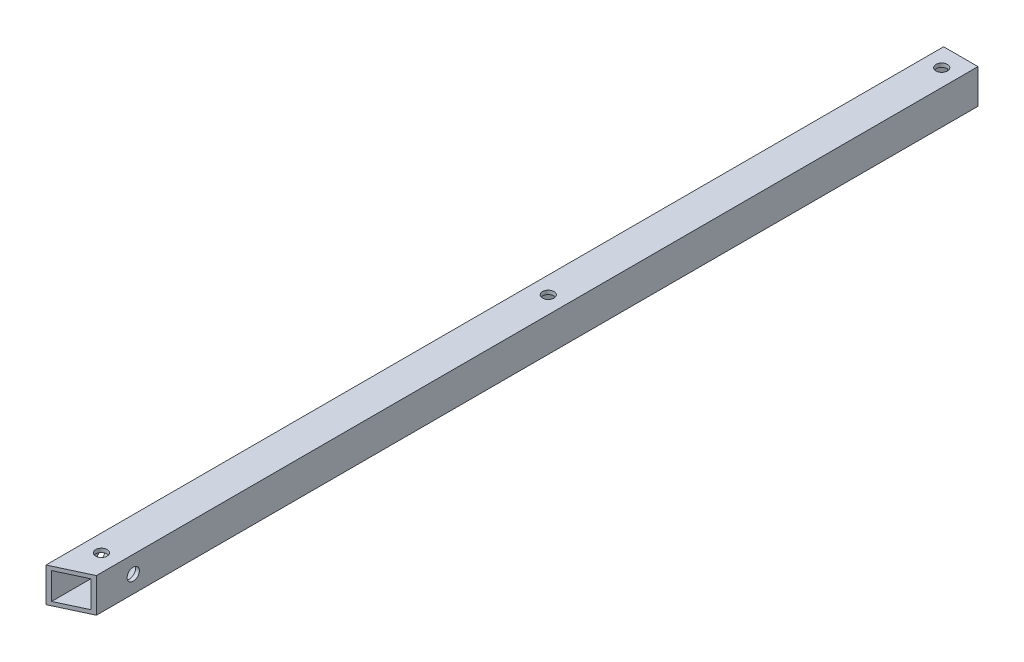
ISO-10303-21;
HEADER;
FILE_DESCRIPTION(('STEP AP214'),'2;1');
FILE_NAME('part.step','',(''),(''),'','','');
FILE_SCHEMA(('AUTOMOTIVE_DESIGN { 1 0 10303 214 1 1 1 1 }'));
ENDSEC;
DATA;
#1=APPLICATION_CONTEXT('core data for automotive mechanical design processes');
#2=APPLICATION_PROTOCOL_DEFINITION('international standard','automotive_design',2000,#1);
#3=PRODUCT_CONTEXT('',#1,'mechanical');
#4=PRODUCT('Part','Part','',(#3));
#5=PRODUCT_RELATED_PRODUCT_CATEGORY('part','',(#4));
#6=PRODUCT_DEFINITION_FORMATION('','',#4);
#7=PRODUCT_DEFINITION_CONTEXT('part definition',#1,'design');
#8=PRODUCT_DEFINITION('design','',#6,#7);
#9=PRODUCT_DEFINITION_SHAPE('','',#8);
#10=(LENGTH_UNIT() NAMED_UNIT(*) SI_UNIT(.MILLI.,.METRE.));
#11=(NAMED_UNIT(*) PLANE_ANGLE_UNIT() SI_UNIT($,.RADIAN.));
#12=(NAMED_UNIT(*) SI_UNIT($,.STERADIAN.) SOLID_ANGLE_UNIT());
#13=UNCERTAINTY_MEASURE_WITH_UNIT(LENGTH_MEASURE(1.E-05),#10,'distance_accuracy_value','');
#14=(GEOMETRIC_REPRESENTATION_CONTEXT(3) GLOBAL_UNCERTAINTY_ASSIGNED_CONTEXT((#13)) GLOBAL_UNIT_ASSIGNED_CONTEXT((#10,
#11,#12)) REPRESENTATION_CONTEXT('',''));
#15=CARTESIAN_POINT('',(0.,0.,0.));
#16=DIRECTION('',(0.,0.,1.));
#17=DIRECTION('',(1.,0.,0.));
#18=AXIS2_PLACEMENT_3D('',#15,#16,#17);
#19=CARTESIAN_POINT('',(4.5,4.5,235.));
#20=DIRECTION('',(-1.,0.,0.));
#21=DIRECTION('',(0.,0.,1.));
#22=AXIS2_PLACEMENT_3D('',#19,#20,#21);
#23=PLANE('',#22);
#24=CARTESIAN_POINT('',(4.5,0.,221.153231076605));
#25=DIRECTION('',(1.,0.,0.));
#26=DIRECTION('',(0.,0.,-1.));
#27=AXIS2_PLACEMENT_3D('',#24,#25,#26);
#28=CIRCLE('',#27,1.59999999999999);
#29=CARTESIAN_POINT('',(4.5,0.,219.553231076605));
#30=VERTEX_POINT('',#29);
#31=EDGE_CURVE('E246',#30,#30,#28,.T.);
#32=ORIENTED_EDGE('',*,*,#31,.F.);
#33=EDGE_LOOP('',(#32));
#34=FACE_BOUND('',#33,.T.);
#35=DIRECTION('',(0.,0.,-1.));
#36=VECTOR('',#35,1.);
#37=CARTESIAN_POINT('',(4.5,4.5,235.));
#38=LINE('',#37,#36);
#39=CARTESIAN_POINT('',(4.5,4.5,230.803231076605));
#40=VERTEX_POINT('',#39);
#41=CARTESIAN_POINT('',(4.5,4.5,0.));
#42=VERTEX_POINT('',#41);
#43=EDGE_CURVE('E48',#40,#42,#38,.T.);
#44=ORIENTED_EDGE('',*,*,#43,.F.);
#45=DIRECTION('',(0.,-1.,0.));
#46=VECTOR('',#45,1.);
#47=CARTESIAN_POINT('',(4.5,4.5,230.803231076605));
#48=LINE('',#47,#46);
#49=CARTESIAN_POINT('',(4.5,-4.5,230.803231076605));
#50=VERTEX_POINT('',#49);
#51=EDGE_CURVE('E104',#40,#50,#48,.T.);
#52=ORIENTED_EDGE('',*,*,#51,.T.);
#53=DIRECTION('',(0.,0.,-1.));
#54=VECTOR('',#53,1.);
#55=CARTESIAN_POINT('',(4.5,-4.5,235.));
#56=LINE('',#55,#54);
#57=CARTESIAN_POINT('',(4.5,-4.5,0.));
#58=VERTEX_POINT('',#57);
#59=EDGE_CURVE('E204',#50,#58,#56,.T.);
#60=ORIENTED_EDGE('',*,*,#59,.T.);
#61=DIRECTION('',(0.,1.,0.));
#62=VECTOR('',#61,1.);
#63=CARTESIAN_POINT('',(4.5,4.5,0.));
#64=LINE('',#63,#62);
#65=EDGE_CURVE('E128',#58,#42,#64,.T.);
#66=ORIENTED_EDGE('',*,*,#65,.T.);
#67=EDGE_LOOP('',(#44,#52,#60,#66));
#68=FACE_BOUND('',#67,.T.);
#69=ADVANCED_FACE('F39',(#34,#68),#23,.F.);
#70=CARTESIAN_POINT('',(-4.5,4.5,235.));
#71=DIRECTION('',(0.,-1.,0.));
#72=DIRECTION('',(0.,0.,-1.));
#73=AXIS2_PLACEMENT_3D('',#70,#71,#72);
#74=PLANE('',#73);
#75=CARTESIAN_POINT('',(0.,4.5,225.));
#76=DIRECTION('',(0.,1.,0.));
#77=DIRECTION('',(0.,0.,1.));
#78=AXIS2_PLACEMENT_3D('',#75,#76,#77);
#79=CIRCLE('',#78,1.5);
#80=CARTESIAN_POINT('',(0.,4.5,226.5));
#81=VERTEX_POINT('',#80);
#82=EDGE_CURVE('E141',#81,#81,#79,.T.);
#83=ORIENTED_EDGE('',*,*,#82,.F.);
#84=EDGE_LOOP('',(#83));
#85=FACE_BOUND('',#84,.T.);
#86=CARTESIAN_POINT('',(0.,4.5,108.));
#87=DIRECTION('',(0.,1.,0.));
#88=DIRECTION('',(0.,0.,1.));
#89=AXIS2_PLACEMENT_3D('',#86,#87,#88);
#90=CIRCLE('',#89,1.5);
#91=CARTESIAN_POINT('',(0.,4.5,109.5));
#92=VERTEX_POINT('',#91);
#93=EDGE_CURVE('E274',#92,#92,#90,.T.);
#94=ORIENTED_EDGE('',*,*,#93,.F.);
#95=EDGE_LOOP('',(#94));
#96=FACE_BOUND('',#95,.T.);
#97=CARTESIAN_POINT('',(0.,4.5,5.));
#98=DIRECTION('',(0.,1.,0.));
#99=DIRECTION('',(0.,0.,1.));
#100=AXIS2_PLACEMENT_3D('',#97,#98,#99);
#101=CIRCLE('',#100,1.5);
#102=CARTESIAN_POINT('',(0.,4.5,6.5));
#103=VERTEX_POINT('',#102);
#104=EDGE_CURVE('E115',#103,#103,#101,.T.);
#105=ORIENTED_EDGE('',*,*,#104,.F.);
#106=EDGE_LOOP('',(#105));
#107=FACE_BOUND('',#106,.T.);
#108=DIRECTION('',(0.,0.,-1.));
#109=VECTOR('',#108,1.);
#110=CARTESIAN_POINT('',(-4.5,4.5,235.));
#111=LINE('',#110,#109);
#112=CARTESIAN_POINT('',(-4.5,4.5,235.));
#113=VERTEX_POINT('',#112);
#114=CARTESIAN_POINT('',(-4.5,4.5,0.));
#115=VERTEX_POINT('',#114);
#116=EDGE_CURVE('E121',#113,#115,#111,.T.);
#117=ORIENTED_EDGE('',*,*,#116,.F.);
#118=DIRECTION('',(-0.906307787036652,0.,0.422618261740695));
#119=VECTOR('',#118,1.);
#120=CARTESIAN_POINT('',(-4.5,4.5,235.));
#121=LINE('',#120,#119);
#122=EDGE_CURVE('E107',#40,#113,#121,.T.);
#123=ORIENTED_EDGE('',*,*,#122,.F.);
#124=ORIENTED_EDGE('',*,*,#43,.T.);
#125=DIRECTION('',(-1.,0.,0.));
#126=VECTOR('',#125,1.);
#127=CARTESIAN_POINT('',(-4.5,4.5,0.));
#128=LINE('',#127,#126);
#129=EDGE_CURVE('E208',#42,#115,#128,.T.);
#130=ORIENTED_EDGE('',*,*,#129,.T.);
#131=EDGE_LOOP('',(#117,#123,#124,#130));
#132=FACE_BOUND('',#131,.T.);
#133=ADVANCED_FACE('F118',(#85,#96,#107,#132),#74,.F.);
#134=CARTESIAN_POINT('',(-4.5,4.5,235.));
#135=DIRECTION('',(1.,0.,0.));
#136=DIRECTION('',(0.,1.,0.));
#137=AXIS2_PLACEMENT_3D('',#134,#135,#136);
#138=PLANE('',#137);
#139=CARTESIAN_POINT('',(-4.5,0.,221.153231076605));
#140=DIRECTION('',(1.,0.,0.));
#141=DIRECTION('',(0.,1.,0.));
#142=AXIS2_PLACEMENT_3D('',#139,#140,#141);
#143=CIRCLE('',#142,1.59999999999999);
#144=CARTESIAN_POINT('',(-4.5,1.59999999999999,221.153231076605));
#145=VERTEX_POINT('',#144);
#146=EDGE_CURVE('E124',#145,#145,#143,.T.);
#147=ORIENTED_EDGE('',*,*,#146,.T.);
#148=EDGE_LOOP('',(#147));
#149=FACE_BOUND('',#148,.T.);
#150=DIRECTION('',(0.,-1.,0.));
#151=VECTOR('',#150,1.);
#152=CARTESIAN_POINT('',(-4.5,4.5,0.));
#153=LINE('',#152,#151);
#154=CARTESIAN_POINT('',(-4.5,-4.5,0.));
#155=VERTEX_POINT('',#154);
#156=EDGE_CURVE('E211',#115,#155,#153,.T.);
#157=ORIENTED_EDGE('',*,*,#156,.T.);
#158=DIRECTION('',(0.,0.,-1.));
#159=VECTOR('',#158,1.);
#160=CARTESIAN_POINT('',(-4.5,-4.5,235.));
#161=LINE('',#160,#159);
#162=CARTESIAN_POINT('',(-4.5,-4.50000000000006,235.));
#163=VERTEX_POINT('',#162);
#164=EDGE_CURVE('E132',#163,#155,#161,.T.);
#165=ORIENTED_EDGE('',*,*,#164,.F.);
#166=DIRECTION('',(0.,-1.,0.));
#167=VECTOR('',#166,1.);
#168=CARTESIAN_POINT('',(-4.5,4.5,235.));
#169=LINE('',#168,#167);
#170=EDGE_CURVE('E201',#113,#163,#169,.T.);
#171=ORIENTED_EDGE('',*,*,#170,.F.);
#172=ORIENTED_EDGE('',*,*,#116,.T.);
#173=EDGE_LOOP('',(#157,#165,#171,#172));
#174=FACE_BOUND('',#173,.T.);
#175=ADVANCED_FACE('F228',(#149,#174),#138,.F.);
#176=CARTESIAN_POINT('',(-4.5,-4.5,235.));
#177=DIRECTION('',(0.,1.,0.));
#178=DIRECTION('',(0.,0.,1.));
#179=AXIS2_PLACEMENT_3D('',#176,#177,#178);
#180=PLANE('',#179);
#181=CARTESIAN_POINT('',(0.,-4.5,225.));
#182=DIRECTION('',(0.,1.,0.));
#183=DIRECTION('',(0.,0.,1.));
#184=AXIS2_PLACEMENT_3D('',#181,#182,#183);
#185=CIRCLE('',#184,1.5);
#186=CARTESIAN_POINT('',(0.,-4.5,226.5));
#187=VERTEX_POINT('',#186);
#188=EDGE_CURVE('E158',#187,#187,#185,.T.);
#189=ORIENTED_EDGE('',*,*,#188,.T.);
#190=EDGE_LOOP('',(#189));
#191=FACE_BOUND('',#190,.T.);
#192=CARTESIAN_POINT('',(0.,-4.5,108.));
#193=DIRECTION('',(0.,1.,0.));
#194=DIRECTION('',(0.,0.,1.));
#195=AXIS2_PLACEMENT_3D('',#192,#193,#194);
#196=CIRCLE('',#195,1.5);
#197=CARTESIAN_POINT('',(0.,-4.5,109.5));
#198=VERTEX_POINT('',#197);
#199=EDGE_CURVE('E152',#198,#198,#196,.T.);
#200=ORIENTED_EDGE('',*,*,#199,.T.);
#201=EDGE_LOOP('',(#200));
#202=FACE_BOUND('',#201,.T.);
#203=CARTESIAN_POINT('',(0.,-4.5,5.));
#204=DIRECTION('',(0.,1.,0.));
#205=DIRECTION('',(0.,0.,1.));
#206=AXIS2_PLACEMENT_3D('',#203,#204,#205);
#207=CIRCLE('',#206,1.5);
#208=CARTESIAN_POINT('',(0.,-4.5,6.5));
#209=VERTEX_POINT('',#208);
#210=EDGE_CURVE('E147',#209,#209,#207,.T.);
#211=ORIENTED_EDGE('',*,*,#210,.T.);
#212=EDGE_LOOP('',(#211));
#213=FACE_BOUND('',#212,.T.);
#214=ORIENTED_EDGE('',*,*,#59,.F.);
#215=DIRECTION('',(-0.906307787036652,0.,0.422618261740695));
#216=VECTOR('',#215,1.);
#217=CARTESIAN_POINT('',(-4.5,-4.5,235.));
#218=LINE('',#217,#216);
#219=EDGE_CURVE('E110',#50,#163,#218,.T.);
#220=ORIENTED_EDGE('',*,*,#219,.T.);
#221=ORIENTED_EDGE('',*,*,#164,.T.);
#222=DIRECTION('',(1.,0.,0.));
#223=VECTOR('',#222,1.);
#224=CARTESIAN_POINT('',(-4.5,-4.5,0.));
#225=LINE('',#224,#223);
#226=EDGE_CURVE('E205',#155,#58,#225,.T.);
#227=ORIENTED_EDGE('',*,*,#226,.T.);
#228=EDGE_LOOP('',(#214,#220,#221,#227));
#229=FACE_BOUND('',#228,.T.);
#230=ADVANCED_FACE('F223',(#191,#202,#213,#229),#180,.F.);
#231=CARTESIAN_POINT('',(0.,0.,0.));
#232=DIRECTION('',(0.,0.,1.));
#233=DIRECTION('',(1.,0.,0.));
#234=AXIS2_PLACEMENT_3D('',#231,#232,#233);
#235=PLANE('',#234);
#236=DIRECTION('',(1.,0.,0.));
#237=VECTOR('',#236,1.);
#238=CARTESIAN_POINT('',(-3.5,-3.5,0.));
#239=LINE('',#238,#237);
#240=CARTESIAN_POINT('',(-3.5,-3.5,0.));
#241=VERTEX_POINT('',#240);
#242=CARTESIAN_POINT('',(3.5,-3.5,0.));
#243=VERTEX_POINT('',#242);
#244=EDGE_CURVE('E182',#241,#243,#239,.T.);
#245=ORIENTED_EDGE('',*,*,#244,.T.);
#246=DIRECTION('',(0.,1.,0.));
#247=VECTOR('',#246,1.);
#248=CARTESIAN_POINT('',(3.5,3.5,0.));
#249=LINE('',#248,#247);
#250=CARTESIAN_POINT('',(3.5,3.5,0.));
#251=VERTEX_POINT('',#250);
#252=EDGE_CURVE('E172',#243,#251,#249,.T.);
#253=ORIENTED_EDGE('',*,*,#252,.T.);
#254=DIRECTION('',(-1.,0.,0.));
#255=VECTOR('',#254,1.);
#256=CARTESIAN_POINT('',(-3.5,3.5,0.));
#257=LINE('',#256,#255);
#258=CARTESIAN_POINT('',(-3.5,3.5,0.));
#259=VERTEX_POINT('',#258);
#260=EDGE_CURVE('E176',#251,#259,#257,.T.);
#261=ORIENTED_EDGE('',*,*,#260,.T.);
#262=DIRECTION('',(0.,-1.,0.));
#263=VECTOR('',#262,1.);
#264=CARTESIAN_POINT('',(-3.5,3.5,0.));
#265=LINE('',#264,#263);
#266=EDGE_CURVE('E62',#259,#241,#265,.T.);
#267=ORIENTED_EDGE('',*,*,#266,.T.);
#268=EDGE_LOOP('',(#245,#253,#261,#267));
#269=FACE_BOUND('',#268,.T.);
#270=ORIENTED_EDGE('',*,*,#65,.F.);
#271=ORIENTED_EDGE('',*,*,#226,.F.);
#272=ORIENTED_EDGE('',*,*,#156,.F.);
#273=ORIENTED_EDGE('',*,*,#129,.F.);
#274=EDGE_LOOP('',(#270,#271,#272,#273));
#275=FACE_BOUND('',#274,.T.);
#276=ADVANCED_FACE('F227',(#269,#275),#235,.F.);
#277=CARTESIAN_POINT('',(3.5,3.5,0.));
#278=DIRECTION('',(1.,0.,0.));
#279=DIRECTION('',(0.,1.,0.));
#280=AXIS2_PLACEMENT_3D('',#277,#278,#279);
#281=PLANE('',#280);
#282=CARTESIAN_POINT('',(3.5,0.,221.153231076605));
#283=DIRECTION('',(1.,0.,0.));
#284=DIRECTION('',(0.,1.,0.));
#285=AXIS2_PLACEMENT_3D('',#282,#283,#284);
#286=CIRCLE('',#285,1.59999999999999);
#287=CARTESIAN_POINT('',(3.5,1.59999999999999,221.153231076605));
#288=VERTEX_POINT('',#287);
#289=EDGE_CURVE('E252',#288,#288,#286,.T.);
#290=ORIENTED_EDGE('',*,*,#289,.T.);
#291=EDGE_LOOP('',(#290));
#292=FACE_BOUND('',#291,.T.);
#293=DIRECTION('',(0.,0.,1.));
#294=VECTOR('',#293,1.);
#295=CARTESIAN_POINT('',(3.5,-3.5,0.));
#296=LINE('',#295,#294);
#297=CARTESIAN_POINT('',(3.5,-3.5,231.26953873476));
#298=VERTEX_POINT('',#297);
#299=EDGE_CURVE('E187',#243,#298,#296,.T.);
#300=ORIENTED_EDGE('',*,*,#299,.T.);
#301=DIRECTION('',(0.,1.,0.));
#302=VECTOR('',#301,1.);
#303=CARTESIAN_POINT('',(3.5,3.49999999999999,231.26953873476));
#304=LINE('',#303,#302);
#305=CARTESIAN_POINT('',(3.5,3.5,231.26953873476));
#306=VERTEX_POINT('',#305);
#307=EDGE_CURVE('E265',#298,#306,#304,.T.);
#308=ORIENTED_EDGE('',*,*,#307,.T.);
#309=DIRECTION('',(0.,0.,1.));
#310=VECTOR('',#309,1.);
#311=CARTESIAN_POINT('',(3.5,3.5,0.));
#312=LINE('',#311,#310);
#313=EDGE_CURVE('E186',#251,#306,#312,.T.);
#314=ORIENTED_EDGE('',*,*,#313,.F.);
#315=ORIENTED_EDGE('',*,*,#252,.F.);
#316=EDGE_LOOP('',(#300,#308,#314,#315));
#317=FACE_BOUND('',#316,.T.);
#318=ADVANCED_FACE('F325',(#292,#317),#281,.F.);
#319=CARTESIAN_POINT('',(-3.5,-3.5,0.));
#320=DIRECTION('',(0.,-1.,0.));
#321=DIRECTION('',(0.,0.,-1.));
#322=AXIS2_PLACEMENT_3D('',#319,#320,#321);
#323=PLANE('',#322);
#324=CARTESIAN_POINT('',(0.,-3.5,225.));
#325=DIRECTION('',(0.,-1.,0.));
#326=DIRECTION('',(0.,0.,-1.));
#327=AXIS2_PLACEMENT_3D('',#324,#325,#326);
#328=CIRCLE('',#327,1.5);
#329=CARTESIAN_POINT('',(0.,-3.5,223.5));
#330=VERTEX_POINT('',#329);
#331=EDGE_CURVE('E151',#330,#330,#328,.T.);
#332=ORIENTED_EDGE('',*,*,#331,.T.);
#333=EDGE_LOOP('',(#332));
#334=FACE_BOUND('',#333,.T.);
#335=CARTESIAN_POINT('',(0.,-3.5,108.));
#336=DIRECTION('',(0.,-1.,0.));
#337=DIRECTION('',(0.,0.,-1.));
#338=AXIS2_PLACEMENT_3D('',#335,#336,#337);
#339=CIRCLE('',#338,1.5);
#340=CARTESIAN_POINT('',(0.,-3.5,106.5));
#341=VERTEX_POINT('',#340);
#342=EDGE_CURVE('E146',#341,#341,#339,.T.);
#343=ORIENTED_EDGE('',*,*,#342,.T.);
#344=EDGE_LOOP('',(#343));
#345=FACE_BOUND('',#344,.T.);
#346=CARTESIAN_POINT('',(0.,-3.5,5.));
#347=DIRECTION('',(0.,-1.,0.));
#348=DIRECTION('',(0.,0.,-1.));
#349=AXIS2_PLACEMENT_3D('',#346,#347,#348);
#350=CIRCLE('',#349,1.5);
#351=CARTESIAN_POINT('',(0.,-3.5,3.5));
#352=VERTEX_POINT('',#351);
#353=EDGE_CURVE('E140',#352,#352,#350,.T.);
#354=ORIENTED_EDGE('',*,*,#353,.T.);
#355=EDGE_LOOP('',(#354));
#356=FACE_BOUND('',#355,.T.);
#357=DIRECTION('',(0.,0.,1.));
#358=VECTOR('',#357,1.);
#359=CARTESIAN_POINT('',(-3.5,-3.5,0.));
#360=LINE('',#359,#358);
#361=CARTESIAN_POINT('',(-3.5,-3.5,234.533692341845));
#362=VERTEX_POINT('',#361);
#363=EDGE_CURVE('E191',#241,#362,#360,.T.);
#364=ORIENTED_EDGE('',*,*,#363,.T.);
#365=DIRECTION('',(0.906307787036652,0.,-0.422618261740695));
#366=VECTOR('',#365,1.);
#367=CARTESIAN_POINT('',(86.3316158713224,-3.5,192.64452191661));
#368=LINE('',#367,#366);
#369=EDGE_CURVE('E261',#362,#298,#368,.T.);
#370=ORIENTED_EDGE('',*,*,#369,.T.);
#371=ORIENTED_EDGE('',*,*,#299,.F.);
#372=ORIENTED_EDGE('',*,*,#244,.F.);
#373=EDGE_LOOP('',(#364,#370,#371,#372));
#374=FACE_BOUND('',#373,.T.);
#375=ADVANCED_FACE('F327',(#334,#345,#356,#374),#323,.F.);
#376=CARTESIAN_POINT('',(-3.5,3.5,0.));
#377=DIRECTION('',(-1.,0.,0.));
#378=DIRECTION('',(0.,-1.,0.));
#379=AXIS2_PLACEMENT_3D('',#376,#377,#378);
#380=PLANE('',#379);
#381=CARTESIAN_POINT('',(-3.5,0.,221.153231076605));
#382=DIRECTION('',(-1.,0.,0.));
#383=DIRECTION('',(0.,-1.,0.));
#384=AXIS2_PLACEMENT_3D('',#381,#382,#383);
#385=CIRCLE('',#384,1.59999999999999);
#386=CARTESIAN_POINT('',(-3.5,-1.59999999999999,221.153231076605));
#387=VERTEX_POINT('',#386);
#388=EDGE_CURVE('E42',#387,#387,#385,.T.);
#389=ORIENTED_EDGE('',*,*,#388,.T.);
#390=EDGE_LOOP('',(#389));
#391=FACE_BOUND('',#390,.T.);
#392=DIRECTION('',(0.,0.,1.));
#393=VECTOR('',#392,1.);
#394=CARTESIAN_POINT('',(-3.5,3.5,0.));
#395=LINE('',#394,#393);
#396=CARTESIAN_POINT('',(-3.5,3.5,234.533692341845));
#397=VERTEX_POINT('',#396);
#398=EDGE_CURVE('E195',#259,#397,#395,.T.);
#399=ORIENTED_EDGE('',*,*,#398,.T.);
#400=DIRECTION('',(0.,-1.,0.));
#401=VECTOR('',#400,1.);
#402=CARTESIAN_POINT('',(-3.5,3.49999999999999,234.533692341845));
#403=LINE('',#402,#401);
#404=EDGE_CURVE('E55',#397,#362,#403,.T.);
#405=ORIENTED_EDGE('',*,*,#404,.T.);
#406=ORIENTED_EDGE('',*,*,#363,.F.);
#407=ORIENTED_EDGE('',*,*,#266,.F.);
#408=EDGE_LOOP('',(#399,#405,#406,#407));
#409=FACE_BOUND('',#408,.T.);
#410=ADVANCED_FACE('F315',(#391,#409),#380,.F.);
#411=CARTESIAN_POINT('',(-3.5,3.5,0.));
#412=DIRECTION('',(0.,1.,0.));
#413=DIRECTION('',(0.,0.,1.));
#414=AXIS2_PLACEMENT_3D('',#411,#412,#413);
#415=PLANE('',#414);
#416=CARTESIAN_POINT('',(0.,3.5,225.));
#417=DIRECTION('',(0.,1.,0.));
#418=DIRECTION('',(0.,0.,1.));
#419=AXIS2_PLACEMENT_3D('',#416,#417,#418);
#420=CIRCLE('',#419,1.5);
#421=CARTESIAN_POINT('',(0.,3.5,226.5));
#422=VERTEX_POINT('',#421);
#423=EDGE_CURVE('E148',#422,#422,#420,.T.);
#424=ORIENTED_EDGE('',*,*,#423,.T.);
#425=EDGE_LOOP('',(#424));
#426=FACE_BOUND('',#425,.T.);
#427=CARTESIAN_POINT('',(0.,3.5,108.));
#428=DIRECTION('',(0.,1.,0.));
#429=DIRECTION('',(0.,0.,1.));
#430=AXIS2_PLACEMENT_3D('',#427,#428,#429);
#431=CIRCLE('',#430,1.5);
#432=CARTESIAN_POINT('',(0.,3.5,109.5));
#433=VERTEX_POINT('',#432);
#434=EDGE_CURVE('E142',#433,#433,#431,.T.);
#435=ORIENTED_EDGE('',*,*,#434,.T.);
#436=EDGE_LOOP('',(#435));
#437=FACE_BOUND('',#436,.T.);
#438=CARTESIAN_POINT('',(0.,3.5,5.));
#439=DIRECTION('',(0.,1.,0.));
#440=DIRECTION('',(0.,0.,1.));
#441=AXIS2_PLACEMENT_3D('',#438,#439,#440);
#442=CIRCLE('',#441,1.5);
#443=CARTESIAN_POINT('',(0.,3.5,6.5));
#444=VERTEX_POINT('',#443);
#445=EDGE_CURVE('E136',#444,#444,#442,.T.);
#446=ORIENTED_EDGE('',*,*,#445,.T.);
#447=EDGE_LOOP('',(#446));
#448=FACE_BOUND('',#447,.T.);
#449=ORIENTED_EDGE('',*,*,#313,.T.);
#450=DIRECTION('',(-0.906307787036652,0.,0.422618261740695));
#451=VECTOR('',#450,1.);
#452=CARTESIAN_POINT('',(86.3316158713224,3.5,192.64452191661));
#453=LINE('',#452,#451);
#454=EDGE_CURVE('E11',#306,#397,#453,.T.);
#455=ORIENTED_EDGE('',*,*,#454,.T.);
#456=ORIENTED_EDGE('',*,*,#398,.F.);
#457=ORIENTED_EDGE('',*,*,#260,.F.);
#458=EDGE_LOOP('',(#449,#455,#456,#457));
#459=FACE_BOUND('',#458,.T.);
#460=ADVANCED_FACE('F308',(#426,#437,#448,#459),#415,.F.);
#461=CARTESIAN_POINT('',(0.,-230.5,5.));
#462=DIRECTION('',(0.,1.,0.));
#463=DIRECTION('',(0.,0.,1.));
#464=AXIS2_PLACEMENT_3D('',#461,#462,#463);
#465=CYLINDRICAL_SURFACE('',#464,1.5);
#466=ORIENTED_EDGE('',*,*,#104,.T.);
#467=EDGE_LOOP('',(#466));
#468=FACE_BOUND('',#467,.T.);
#469=ORIENTED_EDGE('',*,*,#445,.F.);
#470=EDGE_LOOP('',(#469));
#471=FACE_BOUND('',#470,.T.);
#472=ADVANCED_FACE('F294',(#468,#471),#465,.F.);
#473=CARTESIAN_POINT('',(0.,-230.5,108.));
#474=DIRECTION('',(0.,1.,0.));
#475=DIRECTION('',(0.,0.,1.));
#476=AXIS2_PLACEMENT_3D('',#473,#474,#475);
#477=CYLINDRICAL_SURFACE('',#476,1.5);
#478=ORIENTED_EDGE('',*,*,#93,.T.);
#479=EDGE_LOOP('',(#478));
#480=FACE_BOUND('',#479,.T.);
#481=ORIENTED_EDGE('',*,*,#434,.F.);
#482=EDGE_LOOP('',(#481));
#483=FACE_BOUND('',#482,.T.);
#484=ADVANCED_FACE('F302',(#480,#483),#477,.F.);
#485=CARTESIAN_POINT('',(0.,-230.5,225.));
#486=DIRECTION('',(0.,1.,0.));
#487=DIRECTION('',(0.,0.,1.));
#488=AXIS2_PLACEMENT_3D('',#485,#486,#487);
#489=CYLINDRICAL_SURFACE('',#488,1.5);
#490=ORIENTED_EDGE('',*,*,#82,.T.);
#491=EDGE_LOOP('',(#490));
#492=FACE_BOUND('',#491,.T.);
#493=ORIENTED_EDGE('',*,*,#423,.F.);
#494=EDGE_LOOP('',(#493));
#495=FACE_BOUND('',#494,.T.);
#496=ADVANCED_FACE('F291',(#492,#495),#489,.F.);
#497=ORIENTED_EDGE('',*,*,#353,.F.);
#498=EDGE_LOOP('',(#497));
#499=FACE_BOUND('',#498,.T.);
#500=ORIENTED_EDGE('',*,*,#210,.F.);
#501=EDGE_LOOP('',(#500));
#502=FACE_BOUND('',#501,.T.);
#503=ADVANCED_FACE('F288',(#499,#502),#465,.F.);
#504=ORIENTED_EDGE('',*,*,#342,.F.);
#505=EDGE_LOOP('',(#504));
#506=FACE_BOUND('',#505,.T.);
#507=ORIENTED_EDGE('',*,*,#199,.F.);
#508=EDGE_LOOP('',(#507));
#509=FACE_BOUND('',#508,.T.);
#510=ADVANCED_FACE('F290',(#506,#509),#477,.F.);
#511=ORIENTED_EDGE('',*,*,#331,.F.);
#512=EDGE_LOOP('',(#511));
#513=FACE_BOUND('',#512,.T.);
#514=ORIENTED_EDGE('',*,*,#188,.F.);
#515=EDGE_LOOP('',(#514));
#516=FACE_BOUND('',#515,.T.);
#517=ADVANCED_FACE('F299',(#513,#516),#489,.F.);
#518=CARTESIAN_POINT('',(-4.5,-230.5,235.));
#519=DIRECTION('',(-0.422618261740695,0.,-0.906307787036652));
#520=DIRECTION('',(-0.906307787036652,0.,0.422618261740695));
#521=AXIS2_PLACEMENT_3D('',#518,#519,#520);
#522=PLANE('',#521);
#523=ORIENTED_EDGE('',*,*,#369,.F.);
#524=ORIENTED_EDGE('',*,*,#404,.F.);
#525=ORIENTED_EDGE('',*,*,#454,.F.);
#526=ORIENTED_EDGE('',*,*,#307,.F.);
#527=EDGE_LOOP('',(#523,#524,#525,#526));
#528=FACE_BOUND('',#527,.T.);
#529=ORIENTED_EDGE('',*,*,#122,.T.);
#530=ORIENTED_EDGE('',*,*,#170,.T.);
#531=ORIENTED_EDGE('',*,*,#219,.F.);
#532=ORIENTED_EDGE('',*,*,#51,.F.);
#533=EDGE_LOOP('',(#529,#530,#531,#532));
#534=FACE_BOUND('',#533,.T.);
#535=ADVANCED_FACE('F106',(#528,#534),#522,.F.);
#536=CARTESIAN_POINT('',(-5.5,0.,221.153231076605));
#537=DIRECTION('',(1.,0.,0.));
#538=DIRECTION('',(0.,0.,-1.));
#539=AXIS2_PLACEMENT_3D('',#536,#537,#538);
#540=CYLINDRICAL_SURFACE('',#539,1.59999999999999);
#541=ORIENTED_EDGE('',*,*,#388,.F.);
#542=EDGE_LOOP('',(#541));
#543=FACE_BOUND('',#542,.T.);
#544=ORIENTED_EDGE('',*,*,#146,.F.);
#545=EDGE_LOOP('',(#544));
#546=FACE_BOUND('',#545,.T.);
#547=ADVANCED_FACE('F356',(#543,#546),#540,.F.);
#548=ORIENTED_EDGE('',*,*,#31,.T.);
#549=EDGE_LOOP('',(#548));
#550=FACE_BOUND('',#549,.T.);
#551=ORIENTED_EDGE('',*,*,#289,.F.);
#552=EDGE_LOOP('',(#551));
#553=FACE_BOUND('',#552,.T.);
#554=ADVANCED_FACE('F360',(#550,#553),#540,.F.);
#555=CLOSED_SHELL('',(#69,#133,#175,#230,#276,#318,#375,#410,#460,#472,#484,#496,#503,#510,#517,
#535,#547,#554));
#556=MANIFOLD_SOLID_BREP('B2',#555);
#557=ADVANCED_BREP_SHAPE_REPRESENTATION('',(#18,#556),#14);
#558=SHAPE_DEFINITION_REPRESENTATION(#9,#557);
ENDSEC;
END-ISO-10303-21;
